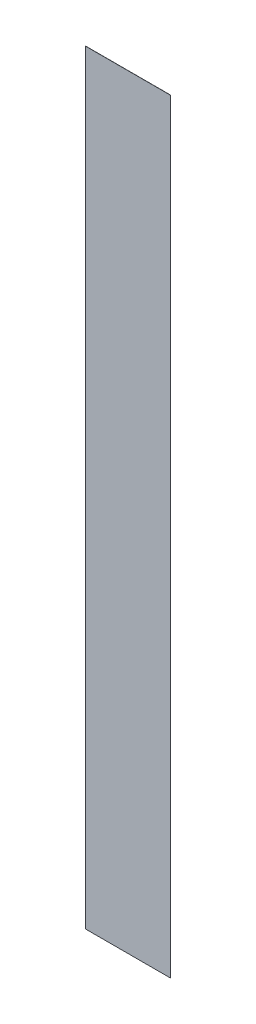
ISO-10303-21;
HEADER;
FILE_DESCRIPTION(('STEP AP214'),'2;1');
FILE_NAME('part.step','',(''),(''),'','','');
FILE_SCHEMA(('AUTOMOTIVE_DESIGN { 1 0 10303 214 1 1 1 1 }'));
ENDSEC;
DATA;
#1=APPLICATION_CONTEXT('core data for automotive mechanical design processes');
#2=APPLICATION_PROTOCOL_DEFINITION('international standard','automotive_design',2000,#1);
#3=PRODUCT_CONTEXT('',#1,'mechanical');
#4=PRODUCT('Part','Part','',(#3));
#5=PRODUCT_RELATED_PRODUCT_CATEGORY('part','',(#4));
#6=PRODUCT_DEFINITION_FORMATION('','',#4);
#7=PRODUCT_DEFINITION_CONTEXT('part definition',#1,'design');
#8=PRODUCT_DEFINITION('design','',#6,#7);
#9=PRODUCT_DEFINITION_SHAPE('','',#8);
#10=(LENGTH_UNIT() NAMED_UNIT(*) SI_UNIT(.MILLI.,.METRE.));
#11=(NAMED_UNIT(*) PLANE_ANGLE_UNIT() SI_UNIT($,.RADIAN.));
#12=(NAMED_UNIT(*) SI_UNIT($,.STERADIAN.) SOLID_ANGLE_UNIT());
#13=UNCERTAINTY_MEASURE_WITH_UNIT(LENGTH_MEASURE(1.E-05),#10,'distance_accuracy_value','');
#14=(GEOMETRIC_REPRESENTATION_CONTEXT(3) GLOBAL_UNCERTAINTY_ASSIGNED_CONTEXT((#13)) GLOBAL_UNIT_ASSIGNED_CONTEXT((#10,
#11,#12)) REPRESENTATION_CONTEXT('',''));
#15=CARTESIAN_POINT('',(0.,0.,0.));
#16=DIRECTION('',(0.,0.,1.));
#17=DIRECTION('',(1.,0.,0.));
#18=AXIS2_PLACEMENT_3D('',#15,#16,#17);
#19=CARTESIAN_POINT('',(-6.77130044843049,2.2085201793722,0.04));
#20=DIRECTION('',(1.,0.,0.));
#21=DIRECTION('',(0.,1.,0.));
#22=AXIS2_PLACEMENT_3D('',#19,#20,#21);
#23=PLANE('',#22);
#24=DIRECTION('',(0.,-1.,0.));
#25=VECTOR('',#24,1.);
#26=CARTESIAN_POINT('',(-6.77130044843049,2.2085201793722,0.));
#27=LINE('',#26,#25);
#28=CARTESIAN_POINT('',(-6.77130044843049,2.2085201793722,0.));
#29=VERTEX_POINT('',#28);
#30=CARTESIAN_POINT('',(-6.77130044843047,-177.791479820628,0.));
#31=VERTEX_POINT('',#30);
#32=EDGE_CURVE('E101',#29,#31,#27,.T.);
#33=ORIENTED_EDGE('',*,*,#32,.T.);
#34=DIRECTION('',(0.,0.,-1.));
#35=VECTOR('',#34,1.);
#36=CARTESIAN_POINT('',(-6.77130044843047,-177.791479820628,0.04));
#37=LINE('',#36,#35);
#38=CARTESIAN_POINT('',(-6.77130044843047,-177.791479820628,0.04));
#39=VERTEX_POINT('',#38);
#40=EDGE_CURVE('E11',#39,#31,#37,.T.);
#41=ORIENTED_EDGE('',*,*,#40,.F.);
#42=DIRECTION('',(0.,-1.,0.));
#43=VECTOR('',#42,1.);
#44=CARTESIAN_POINT('',(-6.77130044843049,2.2085201793722,0.04));
#45=LINE('',#44,#43);
#46=CARTESIAN_POINT('',(-6.77130044843049,2.2085201793722,0.04));
#47=VERTEX_POINT('',#46);
#48=EDGE_CURVE('E89',#47,#39,#45,.T.);
#49=ORIENTED_EDGE('',*,*,#48,.F.);
#50=DIRECTION('',(0.,0.,-1.));
#51=VECTOR('',#50,1.);
#52=CARTESIAN_POINT('',(-6.77130044843049,2.2085201793722,0.04));
#53=LINE('',#52,#51);
#54=EDGE_CURVE('E97',#47,#29,#53,.T.);
#55=ORIENTED_EDGE('',*,*,#54,.T.);
#56=EDGE_LOOP('',(#33,#41,#49,#55));
#57=FACE_BOUND('',#56,.T.);
#58=ADVANCED_FACE('F38',(#57),#23,.F.);
#59=CARTESIAN_POINT('',(-6.77130044843047,-177.791479820628,0.04));
#60=DIRECTION('',(0.,1.,0.));
#61=DIRECTION('',(0.,0.,1.));
#62=AXIS2_PLACEMENT_3D('',#59,#60,#61);
#63=PLANE('',#62);
#64=DIRECTION('',(1.,0.,0.));
#65=VECTOR('',#64,1.);
#66=CARTESIAN_POINT('',(-6.77130044843047,-177.791479820628,0.));
#67=LINE('',#66,#65);
#68=CARTESIAN_POINT('',(13.2286995515695,-177.791479820628,0.));
#69=VERTEX_POINT('',#68);
#70=EDGE_CURVE('E93',#31,#69,#67,.T.);
#71=ORIENTED_EDGE('',*,*,#70,.T.);
#72=DIRECTION('',(0.,0.,-1.));
#73=VECTOR('',#72,1.);
#74=CARTESIAN_POINT('',(13.2286995515695,-177.791479820628,0.04));
#75=LINE('',#74,#73);
#76=CARTESIAN_POINT('',(13.2286995515695,-177.791479820628,0.04));
#77=VERTEX_POINT('',#76);
#78=EDGE_CURVE('E46',#77,#69,#75,.T.);
#79=ORIENTED_EDGE('',*,*,#78,.F.);
#80=DIRECTION('',(1.,0.,0.));
#81=VECTOR('',#80,1.);
#82=CARTESIAN_POINT('',(-6.77130044843047,-177.791479820628,0.04));
#83=LINE('',#82,#81);
#84=EDGE_CURVE('E84',#39,#77,#83,.T.);
#85=ORIENTED_EDGE('',*,*,#84,.F.);
#86=ORIENTED_EDGE('',*,*,#40,.T.);
#87=EDGE_LOOP('',(#71,#79,#85,#86));
#88=FACE_BOUND('',#87,.T.);
#89=ADVANCED_FACE('F92',(#88),#63,.F.);
#90=CARTESIAN_POINT('',(13.2286995515695,2.2085201793722,0.04));
#91=DIRECTION('',(-1.,0.,0.));
#92=DIRECTION('',(0.,-1.,0.));
#93=AXIS2_PLACEMENT_3D('',#90,#91,#92);
#94=PLANE('',#93);
#95=DIRECTION('',(0.,1.,0.));
#96=VECTOR('',#95,1.);
#97=CARTESIAN_POINT('',(13.2286995515695,2.2085201793722,0.));
#98=LINE('',#97,#96);
#99=CARTESIAN_POINT('',(13.2286995515695,2.2085201793722,0.));
#100=VERTEX_POINT('',#99);
#101=EDGE_CURVE('E71',#69,#100,#98,.T.);
#102=ORIENTED_EDGE('',*,*,#101,.T.);
#103=DIRECTION('',(0.,0.,-1.));
#104=VECTOR('',#103,1.);
#105=CARTESIAN_POINT('',(13.2286995515695,2.2085201793722,0.04));
#106=LINE('',#105,#104);
#107=CARTESIAN_POINT('',(13.2286995515695,2.2085201793722,0.04));
#108=VERTEX_POINT('',#107);
#109=EDGE_CURVE('E94',#108,#100,#106,.T.);
#110=ORIENTED_EDGE('',*,*,#109,.F.);
#111=DIRECTION('',(0.,1.,0.));
#112=VECTOR('',#111,1.);
#113=CARTESIAN_POINT('',(13.2286995515695,2.2085201793722,0.04));
#114=LINE('',#113,#112);
#115=EDGE_CURVE('E87',#77,#108,#114,.T.);
#116=ORIENTED_EDGE('',*,*,#115,.F.);
#117=ORIENTED_EDGE('',*,*,#78,.T.);
#118=EDGE_LOOP('',(#102,#110,#116,#117));
#119=FACE_BOUND('',#118,.T.);
#120=ADVANCED_FACE('F95',(#119),#94,.F.);
#121=CARTESIAN_POINT('',(-6.77130044843049,2.2085201793722,0.04));
#122=DIRECTION('',(0.,-1.,0.));
#123=DIRECTION('',(0.,0.,-1.));
#124=AXIS2_PLACEMENT_3D('',#121,#122,#123);
#125=PLANE('',#124);
#126=DIRECTION('',(-1.,0.,0.));
#127=VECTOR('',#126,1.);
#128=CARTESIAN_POINT('',(-6.77130044843049,2.2085201793722,0.));
#129=LINE('',#128,#127);
#130=EDGE_CURVE('E77',#100,#29,#129,.T.);
#131=ORIENTED_EDGE('',*,*,#130,.T.);
#132=ORIENTED_EDGE('',*,*,#54,.F.);
#133=DIRECTION('',(-1.,0.,0.));
#134=VECTOR('',#133,1.);
#135=CARTESIAN_POINT('',(-6.77130044843049,2.2085201793722,0.04));
#136=LINE('',#135,#134);
#137=EDGE_CURVE('E54',#108,#47,#136,.T.);
#138=ORIENTED_EDGE('',*,*,#137,.F.);
#139=ORIENTED_EDGE('',*,*,#109,.T.);
#140=EDGE_LOOP('',(#131,#132,#138,#139));
#141=FACE_BOUND('',#140,.T.);
#142=ADVANCED_FACE('F108',(#141),#125,.F.);
#143=CARTESIAN_POINT('',(0.,0.,0.04));
#144=DIRECTION('',(0.,0.,1.));
#145=DIRECTION('',(1.,0.,0.));
#146=AXIS2_PLACEMENT_3D('',#143,#144,#145);
#147=PLANE('',#146);
#148=ORIENTED_EDGE('',*,*,#48,.T.);
#149=ORIENTED_EDGE('',*,*,#84,.T.);
#150=ORIENTED_EDGE('',*,*,#115,.T.);
#151=ORIENTED_EDGE('',*,*,#137,.T.);
#152=EDGE_LOOP('',(#148,#149,#150,#151));
#153=FACE_BOUND('',#152,.T.);
#154=ADVANCED_FACE('F85',(#153),#147,.T.);
#155=CARTESIAN_POINT('',(0.,0.,0.));
#156=DIRECTION('',(0.,0.,1.));
#157=DIRECTION('',(1.,0.,0.));
#158=AXIS2_PLACEMENT_3D('',#155,#156,#157);
#159=PLANE('',#158);
#160=ORIENTED_EDGE('',*,*,#32,.F.);
#161=ORIENTED_EDGE('',*,*,#130,.F.);
#162=ORIENTED_EDGE('',*,*,#101,.F.);
#163=ORIENTED_EDGE('',*,*,#70,.F.);
#164=EDGE_LOOP('',(#160,#161,#162,#163));
#165=FACE_BOUND('',#164,.T.);
#166=ADVANCED_FACE('F111',(#165),#159,.F.);
#167=CLOSED_SHELL('',(#58,#89,#120,#142,#154,#166));
#168=MANIFOLD_SOLID_BREP('B2',#167);
#169=ADVANCED_BREP_SHAPE_REPRESENTATION('',(#18,#168),#14);
#170=SHAPE_DEFINITION_REPRESENTATION(#9,#169);
ENDSEC;
END-ISO-10303-21;
